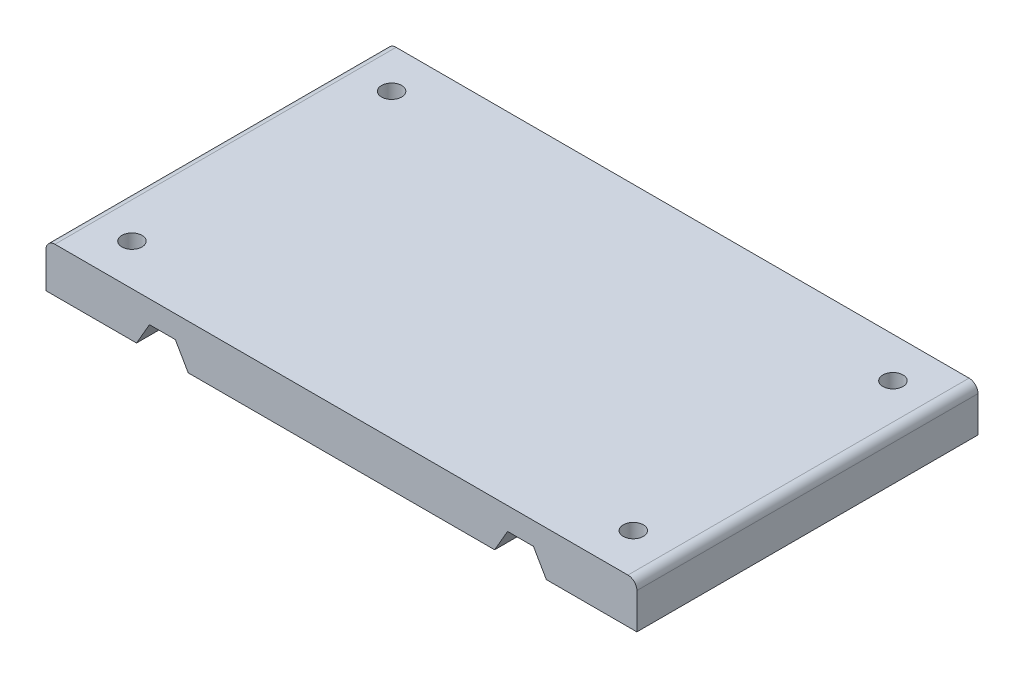
ISO-10303-21;
HEADER;
FILE_DESCRIPTION(('STEP AP214'),'2;1');
FILE_NAME('part.step','',(''),(''),'','','');
FILE_SCHEMA(('AUTOMOTIVE_DESIGN { 1 0 10303 214 1 1 1 1 }'));
ENDSEC;
DATA;
#1=APPLICATION_CONTEXT('core data for automotive mechanical design processes');
#2=APPLICATION_PROTOCOL_DEFINITION('international standard','automotive_design',2000,#1);
#3=PRODUCT_CONTEXT('',#1,'mechanical');
#4=PRODUCT('Part','Part','',(#3));
#5=PRODUCT_RELATED_PRODUCT_CATEGORY('part','',(#4));
#6=PRODUCT_DEFINITION_FORMATION('','',#4);
#7=PRODUCT_DEFINITION_CONTEXT('part definition',#1,'design');
#8=PRODUCT_DEFINITION('design','',#6,#7);
#9=PRODUCT_DEFINITION_SHAPE('','',#8);
#10=(LENGTH_UNIT() NAMED_UNIT(*) SI_UNIT(.MILLI.,.METRE.));
#11=(NAMED_UNIT(*) PLANE_ANGLE_UNIT() SI_UNIT($,.RADIAN.));
#12=(NAMED_UNIT(*) SI_UNIT($,.STERADIAN.) SOLID_ANGLE_UNIT());
#13=UNCERTAINTY_MEASURE_WITH_UNIT(LENGTH_MEASURE(1.E-05),#10,'distance_accuracy_value','');
#14=(GEOMETRIC_REPRESENTATION_CONTEXT(3) GLOBAL_UNCERTAINTY_ASSIGNED_CONTEXT((#13)) GLOBAL_UNIT_ASSIGNED_CONTEXT((#10,
#11,#12)) REPRESENTATION_CONTEXT('',''));
#15=CARTESIAN_POINT('',(0.,0.,0.));
#16=DIRECTION('',(0.,0.,1.));
#17=DIRECTION('',(1.,0.,0.));
#18=AXIS2_PLACEMENT_3D('',#15,#16,#17);
#19=CARTESIAN_POINT('',(-66.,0.,76.2));
#20=DIRECTION('',(0.,1.,0.));
#21=DIRECTION('',(0.,0.,1.));
#22=AXIS2_PLACEMENT_3D('',#19,#20,#21);
#23=PLANE('',#22);
#24=DIRECTION('',(1.,0.,0.));
#25=VECTOR('',#24,1.);
#26=CARTESIAN_POINT('',(-66.,0.,76.2));
#27=LINE('',#26,#25);
#28=CARTESIAN_POINT('',(-34.2264973081037,0.,76.2));
#29=VERTEX_POINT('',#28);
#30=CARTESIAN_POINT('',(34.2264973081037,0.,76.2));
#31=VERTEX_POINT('',#30);
#32=EDGE_CURVE('E268',#29,#31,#27,.T.);
#33=ORIENTED_EDGE('',*,*,#32,.F.);
#34=DIRECTION('',(0.,0.,1.));
#35=VECTOR('',#34,1.);
#36=CARTESIAN_POINT('',(-34.2264973081037,0.,0.));
#37=LINE('',#36,#35);
#38=CARTESIAN_POINT('',(-34.2264973081037,0.,0.));
#39=VERTEX_POINT('',#38);
#40=EDGE_CURVE('E211',#39,#29,#37,.T.);
#41=ORIENTED_EDGE('',*,*,#40,.F.);
#42=DIRECTION('',(1.,0.,0.));
#43=VECTOR('',#42,1.);
#44=CARTESIAN_POINT('',(-66.,0.,0.));
#45=LINE('',#44,#43);
#46=CARTESIAN_POINT('',(34.2264973081037,0.,0.));
#47=VERTEX_POINT('',#46);
#48=EDGE_CURVE('E279',#39,#47,#45,.T.);
#49=ORIENTED_EDGE('',*,*,#48,.T.);
#50=DIRECTION('',(0.,0.,1.));
#51=VECTOR('',#50,1.);
#52=CARTESIAN_POINT('',(34.2264973081037,0.,0.));
#53=LINE('',#52,#51);
#54=EDGE_CURVE('E229',#47,#31,#53,.T.);
#55=ORIENTED_EDGE('',*,*,#54,.T.);
#56=EDGE_LOOP('',(#33,#41,#49,#55));
#57=FACE_BOUND('',#56,.T.);
#58=ADVANCED_FACE('F39',(#57),#23,.F.);
#59=CARTESIAN_POINT('',(56.,0.,8.99999999999999));
#60=DIRECTION('',(0.,1.,0.));
#61=DIRECTION('',(0.,0.,1.));
#62=AXIS2_PLACEMENT_3D('',#59,#60,#61);
#63=CIRCLE('',#62,2.25);
#64=CARTESIAN_POINT('',(56.,0.,11.25));
#65=VERTEX_POINT('',#64);
#66=EDGE_CURVE('E418',#65,#65,#63,.T.);
#67=ORIENTED_EDGE('',*,*,#66,.T.);
#68=EDGE_LOOP('',(#67));
#69=FACE_BOUND('',#68,.T.);
#70=CARTESIAN_POINT('',(56.,0.,67.));
#71=DIRECTION('',(0.,1.,0.));
#72=DIRECTION('',(0.,0.,1.));
#73=AXIS2_PLACEMENT_3D('',#70,#71,#72);
#74=CIRCLE('',#73,2.25);
#75=CARTESIAN_POINT('',(56.,0.,69.25));
#76=VERTEX_POINT('',#75);
#77=EDGE_CURVE('E198',#76,#76,#74,.T.);
#78=ORIENTED_EDGE('',*,*,#77,.T.);
#79=EDGE_LOOP('',(#78));
#80=FACE_BOUND('',#79,.T.);
#81=CARTESIAN_POINT('',(45.7735026918963,0.,76.2));
#82=VERTEX_POINT('',#81);
#83=CARTESIAN_POINT('',(66.,0.,76.2));
#84=VERTEX_POINT('',#83);
#85=EDGE_CURVE('E262',#82,#84,#27,.T.);
#86=ORIENTED_EDGE('',*,*,#85,.F.);
#87=DIRECTION('',(0.,0.,1.));
#88=VECTOR('',#87,1.);
#89=CARTESIAN_POINT('',(45.7735026918963,0.,0.));
#90=LINE('',#89,#88);
#91=CARTESIAN_POINT('',(45.7735026918963,0.,0.));
#92=VERTEX_POINT('',#91);
#93=EDGE_CURVE('E245',#92,#82,#90,.T.);
#94=ORIENTED_EDGE('',*,*,#93,.F.);
#95=CARTESIAN_POINT('',(66.,0.,0.));
#96=VERTEX_POINT('',#95);
#97=EDGE_CURVE('E277',#92,#96,#45,.T.);
#98=ORIENTED_EDGE('',*,*,#97,.T.);
#99=DIRECTION('',(0.,0.,-1.));
#100=VECTOR('',#99,1.);
#101=CARTESIAN_POINT('',(66.,0.,76.2));
#102=LINE('',#101,#100);
#103=EDGE_CURVE('E267',#84,#96,#102,.T.);
#104=ORIENTED_EDGE('',*,*,#103,.F.);
#105=EDGE_LOOP('',(#86,#94,#98,#104));
#106=FACE_BOUND('',#105,.T.);
#107=ADVANCED_FACE('F319',(#69,#80,#106),#23,.F.);
#108=CARTESIAN_POINT('',(-66.,0.,76.2));
#109=DIRECTION('',(-1.,0.,0.));
#110=DIRECTION('',(0.,0.,1.));
#111=AXIS2_PLACEMENT_3D('',#108,#109,#110);
#112=PLANE('',#111);
#113=DIRECTION('',(0.,1.,0.));
#114=VECTOR('',#113,1.);
#115=CARTESIAN_POINT('',(-66.,0.,76.2));
#116=LINE('',#115,#114);
#117=CARTESIAN_POINT('',(-66.,0.,76.2));
#118=VERTEX_POINT('',#117);
#119=CARTESIAN_POINT('',(-66.,8.,76.2));
#120=VERTEX_POINT('',#119);
#121=EDGE_CURVE('E251',#118,#120,#116,.T.);
#122=ORIENTED_EDGE('',*,*,#121,.T.);
#123=DIRECTION('',(0.,0.,-1.));
#124=VECTOR('',#123,1.);
#125=CARTESIAN_POINT('',(-66.,8.,76.2));
#126=LINE('',#125,#124);
#127=CARTESIAN_POINT('',(-66.,8.,0.));
#128=VERTEX_POINT('',#127);
#129=EDGE_CURVE('E11',#120,#128,#126,.T.);
#130=ORIENTED_EDGE('',*,*,#129,.T.);
#131=DIRECTION('',(0.,1.,0.));
#132=VECTOR('',#131,1.);
#133=CARTESIAN_POINT('',(-66.,0.,0.));
#134=LINE('',#133,#132);
#135=CARTESIAN_POINT('',(-66.,0.,0.));
#136=VERTEX_POINT('',#135);
#137=EDGE_CURVE('E210',#136,#128,#134,.T.);
#138=ORIENTED_EDGE('',*,*,#137,.F.);
#139=DIRECTION('',(0.,0.,-1.));
#140=VECTOR('',#139,1.);
#141=CARTESIAN_POINT('',(-66.,0.,76.2));
#142=LINE('',#141,#140);
#143=EDGE_CURVE('E280',#118,#136,#142,.T.);
#144=ORIENTED_EDGE('',*,*,#143,.F.);
#145=EDGE_LOOP('',(#122,#130,#138,#144));
#146=FACE_BOUND('',#145,.T.);
#147=ADVANCED_FACE('F357',(#146),#112,.T.);
#148=CARTESIAN_POINT('',(-56.,0.,67.));
#149=DIRECTION('',(0.,1.,0.));
#150=DIRECTION('',(0.,0.,1.));
#151=AXIS2_PLACEMENT_3D('',#148,#149,#150);
#152=CIRCLE('',#151,2.25);
#153=CARTESIAN_POINT('',(-56.,0.,69.25));
#154=VERTEX_POINT('',#153);
#155=EDGE_CURVE('E372',#154,#154,#152,.T.);
#156=ORIENTED_EDGE('',*,*,#155,.T.);
#157=EDGE_LOOP('',(#156));
#158=FACE_BOUND('',#157,.T.);
#159=CARTESIAN_POINT('',(-56.,0.,8.99999999999999));
#160=DIRECTION('',(0.,1.,0.));
#161=DIRECTION('',(0.,0.,1.));
#162=AXIS2_PLACEMENT_3D('',#159,#160,#161);
#163=CIRCLE('',#162,2.25);
#164=CARTESIAN_POINT('',(-56.,0.,11.25));
#165=VERTEX_POINT('',#164);
#166=EDGE_CURVE('E376',#165,#165,#163,.T.);
#167=ORIENTED_EDGE('',*,*,#166,.T.);
#168=EDGE_LOOP('',(#167));
#169=FACE_BOUND('',#168,.T.);
#170=CARTESIAN_POINT('',(-45.7735026918963,0.,0.));
#171=VERTEX_POINT('',#170);
#172=EDGE_CURVE('E255',#136,#171,#45,.T.);
#173=ORIENTED_EDGE('',*,*,#172,.T.);
#174=DIRECTION('',(0.,0.,1.));
#175=VECTOR('',#174,1.);
#176=CARTESIAN_POINT('',(-45.7735026918963,0.,0.));
#177=LINE('',#176,#175);
#178=CARTESIAN_POINT('',(-45.7735026918963,0.,76.2));
#179=VERTEX_POINT('',#178);
#180=EDGE_CURVE('E177',#171,#179,#177,.T.);
#181=ORIENTED_EDGE('',*,*,#180,.T.);
#182=EDGE_CURVE('E263',#118,#179,#27,.T.);
#183=ORIENTED_EDGE('',*,*,#182,.F.);
#184=ORIENTED_EDGE('',*,*,#143,.T.);
#185=EDGE_LOOP('',(#173,#181,#183,#184));
#186=FACE_BOUND('',#185,.T.);
#187=ADVANCED_FACE('F353',(#158,#169,#186),#23,.F.);
#188=CARTESIAN_POINT('',(66.,0.,76.2));
#189=DIRECTION('',(-1.,0.,0.));
#190=DIRECTION('',(0.,0.,1.));
#191=AXIS2_PLACEMENT_3D('',#188,#189,#190);
#192=PLANE('',#191);
#193=DIRECTION('',(0.,1.,0.));
#194=VECTOR('',#193,1.);
#195=CARTESIAN_POINT('',(66.,0.,0.));
#196=LINE('',#195,#194);
#197=CARTESIAN_POINT('',(66.,8.,0.));
#198=VERTEX_POINT('',#197);
#199=EDGE_CURVE('E274',#96,#198,#196,.T.);
#200=ORIENTED_EDGE('',*,*,#199,.T.);
#201=DIRECTION('',(0.,0.,-1.));
#202=VECTOR('',#201,1.);
#203=CARTESIAN_POINT('',(66.,8.,76.2));
#204=LINE('',#203,#202);
#205=CARTESIAN_POINT('',(66.,8.,76.2));
#206=VERTEX_POINT('',#205);
#207=EDGE_CURVE('E69',#198,#206,#204,.F.);
#208=ORIENTED_EDGE('',*,*,#207,.T.);
#209=DIRECTION('',(0.,1.,0.));
#210=VECTOR('',#209,1.);
#211=CARTESIAN_POINT('',(66.,0.,76.2));
#212=LINE('',#211,#210);
#213=EDGE_CURVE('E259',#84,#206,#212,.T.);
#214=ORIENTED_EDGE('',*,*,#213,.F.);
#215=ORIENTED_EDGE('',*,*,#103,.T.);
#216=EDGE_LOOP('',(#200,#208,#214,#215));
#217=FACE_BOUND('',#216,.T.);
#218=ADVANCED_FACE('F315',(#217),#192,.F.);
#219=CARTESIAN_POINT('',(-66.,10.,76.2));
#220=DIRECTION('',(0.,1.,0.));
#221=DIRECTION('',(0.,0.,1.));
#222=AXIS2_PLACEMENT_3D('',#219,#220,#221);
#223=PLANE('',#222);
#224=CARTESIAN_POINT('',(-56.,10.,67.));
#225=DIRECTION('',(0.,1.,0.));
#226=DIRECTION('',(0.,0.,1.));
#227=AXIS2_PLACEMENT_3D('',#224,#225,#226);
#228=CIRCLE('',#227,2.25);
#229=CARTESIAN_POINT('',(-56.,10.,69.25));
#230=VERTEX_POINT('',#229);
#231=EDGE_CURVE('E405',#230,#230,#228,.T.);
#232=ORIENTED_EDGE('',*,*,#231,.F.);
#233=EDGE_LOOP('',(#232));
#234=FACE_BOUND('',#233,.T.);
#235=CARTESIAN_POINT('',(-56.,10.,8.99999999999999));
#236=DIRECTION('',(0.,1.,0.));
#237=DIRECTION('',(0.,0.,1.));
#238=AXIS2_PLACEMENT_3D('',#235,#236,#237);
#239=CIRCLE('',#238,2.25);
#240=CARTESIAN_POINT('',(-56.,10.,11.25));
#241=VERTEX_POINT('',#240);
#242=EDGE_CURVE('E409',#241,#241,#239,.T.);
#243=ORIENTED_EDGE('',*,*,#242,.F.);
#244=EDGE_LOOP('',(#243));
#245=FACE_BOUND('',#244,.T.);
#246=CARTESIAN_POINT('',(56.,10.,8.99999999999999));
#247=DIRECTION('',(0.,1.,0.));
#248=DIRECTION('',(0.,0.,1.));
#249=AXIS2_PLACEMENT_3D('',#246,#247,#248);
#250=CIRCLE('',#249,2.25);
#251=CARTESIAN_POINT('',(56.,10.,11.25));
#252=VERTEX_POINT('',#251);
#253=EDGE_CURVE('E413',#252,#252,#250,.T.);
#254=ORIENTED_EDGE('',*,*,#253,.F.);
#255=EDGE_LOOP('',(#254));
#256=FACE_BOUND('',#255,.T.);
#257=CARTESIAN_POINT('',(56.,10.,67.));
#258=DIRECTION('',(0.,1.,0.));
#259=DIRECTION('',(0.,0.,1.));
#260=AXIS2_PLACEMENT_3D('',#257,#258,#259);
#261=CIRCLE('',#260,2.25);
#262=CARTESIAN_POINT('',(56.,10.,69.25));
#263=VERTEX_POINT('',#262);
#264=EDGE_CURVE('E416',#263,#263,#261,.T.);
#265=ORIENTED_EDGE('',*,*,#264,.F.);
#266=EDGE_LOOP('',(#265));
#267=FACE_BOUND('',#266,.T.);
#268=DIRECTION('',(1.,0.,0.));
#269=VECTOR('',#268,1.);
#270=CARTESIAN_POINT('',(-66.,10.,76.2));
#271=LINE('',#270,#269);
#272=CARTESIAN_POINT('',(-64.,10.,76.2));
#273=VERTEX_POINT('',#272);
#274=CARTESIAN_POINT('',(64.,10.,76.2));
#275=VERTEX_POINT('',#274);
#276=EDGE_CURVE('E254',#273,#275,#271,.T.);
#277=ORIENTED_EDGE('',*,*,#276,.T.);
#278=DIRECTION('',(0.,0.,-1.));
#279=VECTOR('',#278,1.);
#280=CARTESIAN_POINT('',(64.,10.,0.));
#281=LINE('',#280,#279);
#282=CARTESIAN_POINT('',(64.,10.,0.));
#283=VERTEX_POINT('',#282);
#284=EDGE_CURVE('E289',#275,#283,#281,.T.);
#285=ORIENTED_EDGE('',*,*,#284,.T.);
#286=DIRECTION('',(1.,0.,0.));
#287=VECTOR('',#286,1.);
#288=CARTESIAN_POINT('',(-66.,10.,0.));
#289=LINE('',#288,#287);
#290=CARTESIAN_POINT('',(-64.,10.,0.));
#291=VERTEX_POINT('',#290);
#292=EDGE_CURVE('E271',#291,#283,#289,.T.);
#293=ORIENTED_EDGE('',*,*,#292,.F.);
#294=DIRECTION('',(0.,0.,-1.));
#295=VECTOR('',#294,1.);
#296=CARTESIAN_POINT('',(-64.,10.,76.2));
#297=LINE('',#296,#295);
#298=EDGE_CURVE('E283',#291,#273,#297,.F.);
#299=ORIENTED_EDGE('',*,*,#298,.T.);
#300=EDGE_LOOP('',(#277,#285,#293,#299));
#301=FACE_BOUND('',#300,.T.);
#302=ADVANCED_FACE('F309',(#234,#245,#256,#267,#301),#223,.T.);
#303=CARTESIAN_POINT('',(0.,0.,76.2));
#304=DIRECTION('',(0.,0.,-1.));
#305=DIRECTION('',(-1.,0.,0.));
#306=AXIS2_PLACEMENT_3D('',#303,#304,#305);
#307=PLANE('',#306);
#308=ORIENTED_EDGE('',*,*,#213,.T.);
#309=CARTESIAN_POINT('',(64.,8.,76.2));
#310=DIRECTION('',(0.,0.,-1.));
#311=DIRECTION('',(-1.,0.,0.));
#312=AXIS2_PLACEMENT_3D('',#309,#310,#311);
#313=CIRCLE('',#312,2.);
#314=EDGE_CURVE('E48',#206,#275,#313,.F.);
#315=ORIENTED_EDGE('',*,*,#314,.T.);
#316=ORIENTED_EDGE('',*,*,#276,.F.);
#317=CARTESIAN_POINT('',(-64.,8.,76.2));
#318=DIRECTION('',(0.,0.,-1.));
#319=DIRECTION('',(-1.,0.,0.));
#320=AXIS2_PLACEMENT_3D('',#317,#318,#319);
#321=CIRCLE('',#320,2.);
#322=EDGE_CURVE('E58',#273,#120,#321,.F.);
#323=ORIENTED_EDGE('',*,*,#322,.T.);
#324=ORIENTED_EDGE('',*,*,#121,.F.);
#325=ORIENTED_EDGE('',*,*,#182,.T.);
#326=DIRECTION('',(-0.5,-0.866025403784439,0.));
#327=VECTOR('',#326,1.);
#328=CARTESIAN_POINT('',(-45.7735026918963,0.,76.2));
#329=LINE('',#328,#327);
#330=CARTESIAN_POINT('',(-42.8867513459481,5.,76.2));
#331=VERTEX_POINT('',#330);
#332=EDGE_CURVE('E195',#331,#179,#329,.T.);
#333=ORIENTED_EDGE('',*,*,#332,.F.);
#334=DIRECTION('',(-1.,0.,0.));
#335=VECTOR('',#334,1.);
#336=CARTESIAN_POINT('',(-42.8867513459481,5.,76.2));
#337=LINE('',#336,#335);
#338=CARTESIAN_POINT('',(-37.1132486540519,5.,76.2));
#339=VERTEX_POINT('',#338);
#340=EDGE_CURVE('E173',#339,#331,#337,.T.);
#341=ORIENTED_EDGE('',*,*,#340,.F.);
#342=DIRECTION('',(-0.500000000000001,0.866025403784438,0.));
#343=VECTOR('',#342,1.);
#344=CARTESIAN_POINT('',(-37.1132486540519,5.,76.2));
#345=LINE('',#344,#343);
#346=EDGE_CURVE('E191',#29,#339,#345,.T.);
#347=ORIENTED_EDGE('',*,*,#346,.F.);
#348=ORIENTED_EDGE('',*,*,#32,.T.);
#349=DIRECTION('',(-0.500000000000001,-0.866025403784438,0.));
#350=VECTOR('',#349,1.);
#351=CARTESIAN_POINT('',(37.1132486540519,5.,76.2));
#352=LINE('',#351,#350);
#353=CARTESIAN_POINT('',(37.1132486540519,5.,76.2));
#354=VERTEX_POINT('',#353);
#355=EDGE_CURVE('E230',#354,#31,#352,.T.);
#356=ORIENTED_EDGE('',*,*,#355,.F.);
#357=DIRECTION('',(-1.,0.,0.));
#358=VECTOR('',#357,1.);
#359=CARTESIAN_POINT('',(42.8867513459481,5.,76.2));
#360=LINE('',#359,#358);
#361=CARTESIAN_POINT('',(42.8867513459481,5.,76.2));
#362=VERTEX_POINT('',#361);
#363=EDGE_CURVE('E221',#362,#354,#360,.T.);
#364=ORIENTED_EDGE('',*,*,#363,.F.);
#365=DIRECTION('',(-0.5,0.866025403784439,0.));
#366=VECTOR('',#365,1.);
#367=CARTESIAN_POINT('',(45.7735026918963,0.,76.2));
#368=LINE('',#367,#366);
#369=EDGE_CURVE('E233',#82,#362,#368,.T.);
#370=ORIENTED_EDGE('',*,*,#369,.F.);
#371=ORIENTED_EDGE('',*,*,#85,.T.);
#372=EDGE_LOOP('',(#308,#315,#316,#323,#324,#325,#333,#341,#347,#348,#356,#364,#370,#371));
#373=FACE_BOUND('',#372,.T.);
#374=ADVANCED_FACE('F305',(#373),#307,.F.);
#375=CARTESIAN_POINT('',(0.,0.,0.));
#376=DIRECTION('',(0.,0.,-1.));
#377=DIRECTION('',(-1.,0.,0.));
#378=AXIS2_PLACEMENT_3D('',#375,#376,#377);
#379=PLANE('',#378);
#380=ORIENTED_EDGE('',*,*,#292,.T.);
#381=CARTESIAN_POINT('',(64.,8.,0.));
#382=DIRECTION('',(0.,0.,-1.));
#383=DIRECTION('',(-1.,0.,0.));
#384=AXIS2_PLACEMENT_3D('',#381,#382,#383);
#385=CIRCLE('',#384,2.);
#386=EDGE_CURVE('E295',#283,#198,#385,.T.);
#387=ORIENTED_EDGE('',*,*,#386,.T.);
#388=ORIENTED_EDGE('',*,*,#199,.F.);
#389=ORIENTED_EDGE('',*,*,#97,.F.);
#390=DIRECTION('',(-0.5,0.866025403784439,0.));
#391=VECTOR('',#390,1.);
#392=CARTESIAN_POINT('',(45.7735026918963,0.,0.));
#393=LINE('',#392,#391);
#394=CARTESIAN_POINT('',(42.8867513459481,5.,0.));
#395=VERTEX_POINT('',#394);
#396=EDGE_CURVE('E220',#92,#395,#393,.T.);
#397=ORIENTED_EDGE('',*,*,#396,.T.);
#398=DIRECTION('',(-1.,0.,0.));
#399=VECTOR('',#398,1.);
#400=CARTESIAN_POINT('',(42.8867513459481,5.,0.));
#401=LINE('',#400,#399);
#402=CARTESIAN_POINT('',(37.1132486540519,5.,0.));
#403=VERTEX_POINT('',#402);
#404=EDGE_CURVE('E225',#395,#403,#401,.T.);
#405=ORIENTED_EDGE('',*,*,#404,.T.);
#406=DIRECTION('',(-0.500000000000001,-0.866025403784438,0.));
#407=VECTOR('',#406,1.);
#408=CARTESIAN_POINT('',(37.1132486540519,5.,0.));
#409=LINE('',#408,#407);
#410=EDGE_CURVE('E216',#403,#47,#409,.T.);
#411=ORIENTED_EDGE('',*,*,#410,.T.);
#412=ORIENTED_EDGE('',*,*,#48,.F.);
#413=DIRECTION('',(-0.500000000000001,0.866025403784438,0.));
#414=VECTOR('',#413,1.);
#415=CARTESIAN_POINT('',(-37.1132486540519,5.,0.));
#416=LINE('',#415,#414);
#417=CARTESIAN_POINT('',(-37.1132486540519,5.,0.));
#418=VERTEX_POINT('',#417);
#419=EDGE_CURVE('E178',#39,#418,#416,.T.);
#420=ORIENTED_EDGE('',*,*,#419,.T.);
#421=DIRECTION('',(-1.,0.,0.));
#422=VECTOR('',#421,1.);
#423=CARTESIAN_POINT('',(-42.8867513459481,5.,0.));
#424=LINE('',#423,#422);
#425=CARTESIAN_POINT('',(-42.8867513459481,5.,0.));
#426=VERTEX_POINT('',#425);
#427=EDGE_CURVE('E170',#418,#426,#424,.T.);
#428=ORIENTED_EDGE('',*,*,#427,.T.);
#429=DIRECTION('',(-0.5,-0.866025403784439,0.));
#430=VECTOR('',#429,1.);
#431=CARTESIAN_POINT('',(-45.7735026918963,0.,0.));
#432=LINE('',#431,#430);
#433=EDGE_CURVE('E181',#426,#171,#432,.T.);
#434=ORIENTED_EDGE('',*,*,#433,.T.);
#435=ORIENTED_EDGE('',*,*,#172,.F.);
#436=ORIENTED_EDGE('',*,*,#137,.T.);
#437=CARTESIAN_POINT('',(-64.,8.,0.));
#438=DIRECTION('',(0.,0.,-1.));
#439=DIRECTION('',(-1.,0.,0.));
#440=AXIS2_PLACEMENT_3D('',#437,#438,#439);
#441=CIRCLE('',#440,2.);
#442=EDGE_CURVE('E293',#128,#291,#441,.T.);
#443=ORIENTED_EDGE('',*,*,#442,.T.);
#444=EDGE_LOOP('',(#380,#387,#388,#389,#397,#405,#411,#412,#420,#428,#434,#435,#436,#443));
#445=FACE_BOUND('',#444,.T.);
#446=ADVANCED_FACE('F189',(#445),#379,.T.);
#447=CARTESIAN_POINT('',(37.1132486540519,5.,0.));
#448=DIRECTION('',(-0.866025403784438,0.500000000000001,0.));
#449=DIRECTION('',(-0.500000000000001,-0.866025403784438,0.));
#450=AXIS2_PLACEMENT_3D('',#447,#448,#449);
#451=PLANE('',#450);
#452=ORIENTED_EDGE('',*,*,#355,.T.);
#453=ORIENTED_EDGE('',*,*,#54,.F.);
#454=ORIENTED_EDGE('',*,*,#410,.F.);
#455=DIRECTION('',(0.,0.,1.));
#456=VECTOR('',#455,1.);
#457=CARTESIAN_POINT('',(37.1132486540519,5.,0.));
#458=LINE('',#457,#456);
#459=EDGE_CURVE('E204',#403,#354,#458,.T.);
#460=ORIENTED_EDGE('',*,*,#459,.T.);
#461=EDGE_LOOP('',(#452,#453,#454,#460));
#462=FACE_BOUND('',#461,.T.);
#463=ADVANCED_FACE('F330',(#462),#451,.F.);
#464=CARTESIAN_POINT('',(42.8867513459481,5.,0.));
#465=DIRECTION('',(0.,1.,0.));
#466=DIRECTION('',(0.,0.,1.));
#467=AXIS2_PLACEMENT_3D('',#464,#465,#466);
#468=PLANE('',#467);
#469=ORIENTED_EDGE('',*,*,#363,.T.);
#470=ORIENTED_EDGE('',*,*,#459,.F.);
#471=ORIENTED_EDGE('',*,*,#404,.F.);
#472=DIRECTION('',(0.,0.,1.));
#473=VECTOR('',#472,1.);
#474=CARTESIAN_POINT('',(42.8867513459481,5.,0.));
#475=LINE('',#474,#473);
#476=EDGE_CURVE('E242',#395,#362,#475,.T.);
#477=ORIENTED_EDGE('',*,*,#476,.T.);
#478=EDGE_LOOP('',(#469,#470,#471,#477));
#479=FACE_BOUND('',#478,.T.);
#480=ADVANCED_FACE('F341',(#479),#468,.F.);
#481=CARTESIAN_POINT('',(45.7735026918963,0.,0.));
#482=DIRECTION('',(0.866025403784439,0.5,0.));
#483=DIRECTION('',(-0.5,0.866025403784439,0.));
#484=AXIS2_PLACEMENT_3D('',#481,#482,#483);
#485=PLANE('',#484);
#486=ORIENTED_EDGE('',*,*,#369,.T.);
#487=ORIENTED_EDGE('',*,*,#476,.F.);
#488=ORIENTED_EDGE('',*,*,#396,.F.);
#489=ORIENTED_EDGE('',*,*,#93,.T.);
#490=EDGE_LOOP('',(#486,#487,#488,#489));
#491=FACE_BOUND('',#490,.T.);
#492=ADVANCED_FACE('F339',(#491),#485,.F.);
#493=CARTESIAN_POINT('',(-42.8867513459481,5.,0.));
#494=DIRECTION('',(0.,1.,0.));
#495=DIRECTION('',(0.,0.,1.));
#496=AXIS2_PLACEMENT_3D('',#493,#494,#495);
#497=PLANE('',#496);
#498=ORIENTED_EDGE('',*,*,#340,.T.);
#499=DIRECTION('',(0.,0.,1.));
#500=VECTOR('',#499,1.);
#501=CARTESIAN_POINT('',(-42.8867513459481,5.,0.));
#502=LINE('',#501,#500);
#503=EDGE_CURVE('E166',#426,#331,#502,.T.);
#504=ORIENTED_EDGE('',*,*,#503,.F.);
#505=ORIENTED_EDGE('',*,*,#427,.F.);
#506=DIRECTION('',(0.,0.,1.));
#507=VECTOR('',#506,1.);
#508=CARTESIAN_POINT('',(-37.1132486540519,5.,0.));
#509=LINE('',#508,#507);
#510=EDGE_CURVE('E207',#418,#339,#509,.T.);
#511=ORIENTED_EDGE('',*,*,#510,.T.);
#512=EDGE_LOOP('',(#498,#504,#505,#511));
#513=FACE_BOUND('',#512,.T.);
#514=ADVANCED_FACE('F168',(#513),#497,.F.);
#515=CARTESIAN_POINT('',(-37.1132486540519,5.,0.));
#516=DIRECTION('',(0.866025403784438,0.500000000000001,0.));
#517=DIRECTION('',(-0.500000000000001,0.866025403784438,0.));
#518=AXIS2_PLACEMENT_3D('',#515,#516,#517);
#519=PLANE('',#518);
#520=ORIENTED_EDGE('',*,*,#346,.T.);
#521=ORIENTED_EDGE('',*,*,#510,.F.);
#522=ORIENTED_EDGE('',*,*,#419,.F.);
#523=ORIENTED_EDGE('',*,*,#40,.T.);
#524=EDGE_LOOP('',(#520,#521,#522,#523));
#525=FACE_BOUND('',#524,.T.);
#526=ADVANCED_FACE('F393',(#525),#519,.F.);
#527=CARTESIAN_POINT('',(-45.7735026918963,0.,0.));
#528=DIRECTION('',(-0.866025403784439,0.5,0.));
#529=DIRECTION('',(-0.5,-0.866025403784439,0.));
#530=AXIS2_PLACEMENT_3D('',#527,#528,#529);
#531=PLANE('',#530);
#532=ORIENTED_EDGE('',*,*,#332,.T.);
#533=ORIENTED_EDGE('',*,*,#180,.F.);
#534=ORIENTED_EDGE('',*,*,#433,.F.);
#535=ORIENTED_EDGE('',*,*,#503,.T.);
#536=EDGE_LOOP('',(#532,#533,#534,#535));
#537=FACE_BOUND('',#536,.T.);
#538=ADVANCED_FACE('F182',(#537),#531,.F.);
#539=CARTESIAN_POINT('',(64.,8.,76.2));
#540=DIRECTION('',(0.,0.,1.));
#541=DIRECTION('',(1.,0.,0.));
#542=AXIS2_PLACEMENT_3D('',#539,#540,#541);
#543=CYLINDRICAL_SURFACE('',#542,2.);
#544=ORIENTED_EDGE('',*,*,#314,.F.);
#545=ORIENTED_EDGE('',*,*,#207,.F.);
#546=ORIENTED_EDGE('',*,*,#386,.F.);
#547=ORIENTED_EDGE('',*,*,#284,.F.);
#548=EDGE_LOOP('',(#544,#545,#546,#547));
#549=FACE_BOUND('',#548,.T.);
#550=ADVANCED_FACE('F312',(#549),#543,.T.);
#551=CARTESIAN_POINT('',(-64.,8.,76.2));
#552=DIRECTION('',(0.,0.,-1.));
#553=DIRECTION('',(-1.,0.,0.));
#554=AXIS2_PLACEMENT_3D('',#551,#552,#553);
#555=CYLINDRICAL_SURFACE('',#554,2.);
#556=ORIENTED_EDGE('',*,*,#322,.F.);
#557=ORIENTED_EDGE('',*,*,#298,.F.);
#558=ORIENTED_EDGE('',*,*,#442,.F.);
#559=ORIENTED_EDGE('',*,*,#129,.F.);
#560=EDGE_LOOP('',(#556,#557,#558,#559));
#561=FACE_BOUND('',#560,.T.);
#562=ADVANCED_FACE('F41',(#561),#555,.T.);
#563=CARTESIAN_POINT('',(56.,10.,67.));
#564=DIRECTION('',(0.,1.,0.));
#565=DIRECTION('',(0.,0.,1.));
#566=AXIS2_PLACEMENT_3D('',#563,#564,#565);
#567=CYLINDRICAL_SURFACE('',#566,2.25);
#568=ORIENTED_EDGE('',*,*,#77,.F.);
#569=EDGE_LOOP('',(#568));
#570=FACE_BOUND('',#569,.T.);
#571=ORIENTED_EDGE('',*,*,#264,.T.);
#572=EDGE_LOOP('',(#571));
#573=FACE_BOUND('',#572,.T.);
#574=ADVANCED_FACE('F382',(#570,#573),#567,.F.);
#575=CARTESIAN_POINT('',(56.,10.,8.99999999999999));
#576=DIRECTION('',(0.,1.,0.));
#577=DIRECTION('',(0.,0.,1.));
#578=AXIS2_PLACEMENT_3D('',#575,#576,#577);
#579=CYLINDRICAL_SURFACE('',#578,2.25);
#580=ORIENTED_EDGE('',*,*,#66,.F.);
#581=EDGE_LOOP('',(#580));
#582=FACE_BOUND('',#581,.T.);
#583=ORIENTED_EDGE('',*,*,#253,.T.);
#584=EDGE_LOOP('',(#583));
#585=FACE_BOUND('',#584,.T.);
#586=ADVANCED_FACE('F387',(#582,#585),#579,.F.);
#587=CARTESIAN_POINT('',(-56.,10.,8.99999999999999));
#588=DIRECTION('',(0.,1.,0.));
#589=DIRECTION('',(0.,0.,1.));
#590=AXIS2_PLACEMENT_3D('',#587,#588,#589);
#591=CYLINDRICAL_SURFACE('',#590,2.25);
#592=ORIENTED_EDGE('',*,*,#166,.F.);
#593=EDGE_LOOP('',(#592));
#594=FACE_BOUND('',#593,.T.);
#595=ORIENTED_EDGE('',*,*,#242,.T.);
#596=EDGE_LOOP('',(#595));
#597=FACE_BOUND('',#596,.T.);
#598=ADVANCED_FACE('F434',(#594,#597),#591,.F.);
#599=CARTESIAN_POINT('',(-56.,10.,67.));
#600=DIRECTION('',(0.,1.,0.));
#601=DIRECTION('',(0.,0.,1.));
#602=AXIS2_PLACEMENT_3D('',#599,#600,#601);
#603=CYLINDRICAL_SURFACE('',#602,2.25);
#604=ORIENTED_EDGE('',*,*,#155,.F.);
#605=EDGE_LOOP('',(#604));
#606=FACE_BOUND('',#605,.T.);
#607=ORIENTED_EDGE('',*,*,#231,.T.);
#608=EDGE_LOOP('',(#607));
#609=FACE_BOUND('',#608,.T.);
#610=ADVANCED_FACE('F432',(#606,#609),#603,.F.);
#611=CLOSED_SHELL('',(#58,#107,#147,#187,#218,#302,#374,#446,#463,#480,#492,#514,#526,#538,#550,
#562,#574,#586,#598,#610));
#612=MANIFOLD_SOLID_BREP('B2',#611);
#613=ADVANCED_BREP_SHAPE_REPRESENTATION('',(#18,#612),#14);
#614=SHAPE_DEFINITION_REPRESENTATION(#9,#613);
ENDSEC;
END-ISO-10303-21;
